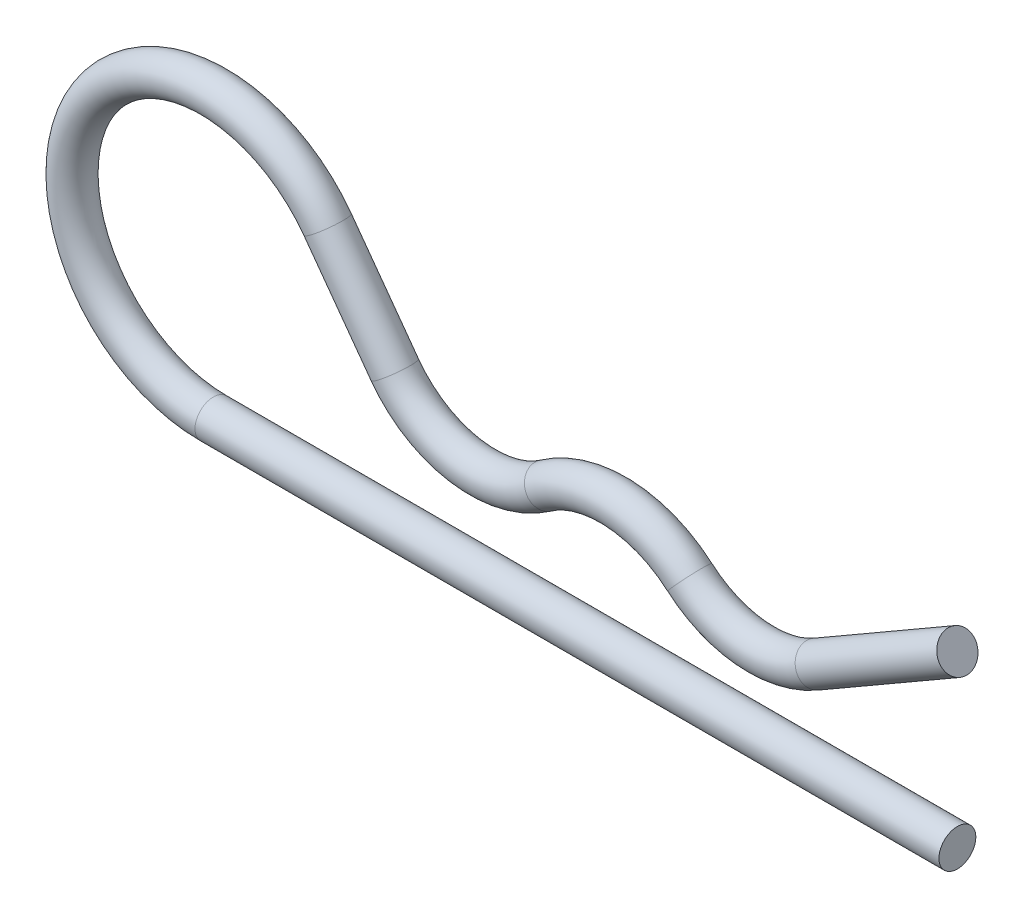
ISO-10303-21;
HEADER;
FILE_DESCRIPTION(('STEP AP214'),'2;1');
FILE_NAME('part.step','',(''),(''),'','','');
FILE_SCHEMA(('AUTOMOTIVE_DESIGN { 1 0 10303 214 1 1 1 1 }'));
ENDSEC;
DATA;
#1=APPLICATION_CONTEXT('core data for automotive mechanical design processes');
#2=APPLICATION_PROTOCOL_DEFINITION('international standard','automotive_design',2000,#1);
#3=PRODUCT_CONTEXT('',#1,'mechanical');
#4=PRODUCT('Part','Part','',(#3));
#5=PRODUCT_RELATED_PRODUCT_CATEGORY('part','',(#4));
#6=PRODUCT_DEFINITION_FORMATION('','',#4);
#7=PRODUCT_DEFINITION_CONTEXT('part definition',#1,'design');
#8=PRODUCT_DEFINITION('design','',#6,#7);
#9=PRODUCT_DEFINITION_SHAPE('','',#8);
#10=(LENGTH_UNIT() NAMED_UNIT(*) SI_UNIT(.MILLI.,.METRE.));
#11=(NAMED_UNIT(*) PLANE_ANGLE_UNIT() SI_UNIT($,.RADIAN.));
#12=(NAMED_UNIT(*) SI_UNIT($,.STERADIAN.) SOLID_ANGLE_UNIT());
#13=UNCERTAINTY_MEASURE_WITH_UNIT(LENGTH_MEASURE(1.E-05),#10,'distance_accuracy_value','');
#14=(GEOMETRIC_REPRESENTATION_CONTEXT(3) GLOBAL_UNCERTAINTY_ASSIGNED_CONTEXT((#13)) GLOBAL_UNIT_ASSIGNED_CONTEXT((#10,
#11,#12)) REPRESENTATION_CONTEXT('',''));
#15=CARTESIAN_POINT('',(0.,0.,0.));
#16=DIRECTION('',(0.,0.,1.));
#17=DIRECTION('',(1.,0.,0.));
#18=AXIS2_PLACEMENT_3D('',#15,#16,#17);
#19=CARTESIAN_POINT('',(60.5,2.31833780332165,0.));
#20=DIRECTION('',(-0.866025403784438,-0.500000000000002,0.));
#21=DIRECTION('',(0.,0.,-1.));
#22=AXIS2_PLACEMENT_3D('',#19,#20,#21);
#23=PLANE('',#22);
#24=CARTESIAN_POINT('',(60.5,2.31833780332165,0.));
#25=DIRECTION('',(-0.866025403784438,-0.500000000000002,0.));
#26=DIRECTION('',(0.,0.,-1.));
#27=AXIS2_PLACEMENT_3D('',#24,#25,#26);
#28=CIRCLE('',#27,1.5);
#29=CARTESIAN_POINT('',(60.5,2.31833780332165,-1.5));
#30=VERTEX_POINT('',#29);
#31=EDGE_CURVE('E63',#30,#30,#28,.T.);
#32=ORIENTED_EDGE('',*,*,#31,.F.);
#33=EDGE_LOOP('',(#32));
#34=FACE_BOUND('',#33,.T.);
#35=ADVANCED_FACE('F35',(#34),#23,.F.);
#36=CARTESIAN_POINT('',(60.5,-11.5,0.));
#37=DIRECTION('',(1.,0.,0.));
#38=DIRECTION('',(0.,0.,-1.));
#39=AXIS2_PLACEMENT_3D('',#36,#37,#38);
#40=PLANE('',#39);
#41=CARTESIAN_POINT('',(60.5,-11.5,0.));
#42=DIRECTION('',(1.,0.,0.));
#43=DIRECTION('',(0.,0.,-1.));
#44=AXIS2_PLACEMENT_3D('',#41,#42,#43);
#45=CIRCLE('',#44,1.5);
#46=CARTESIAN_POINT('',(60.5,-11.5,-1.5));
#47=VERTEX_POINT('',#46);
#48=EDGE_CURVE('E10',#47,#47,#45,.T.);
#49=ORIENTED_EDGE('',*,*,#48,.T.);
#50=EDGE_LOOP('',(#49));
#51=FACE_BOUND('',#50,.T.);
#52=ADVANCED_FACE('F70',(#51),#40,.T.);
#53=CARTESIAN_POINT('',(60.5,2.31833780332165,0.));
#54=DIRECTION('',(-0.866025403784438,-0.500000000000001,0.));
#55=DIRECTION('',(0.500000000000001,-0.866025403784438,0.));
#56=AXIS2_PLACEMENT_3D('',#53,#54,#55);
#57=CYLINDRICAL_SURFACE('',#56,1.5);
#58=CARTESIAN_POINT('',(48.9866630697245,-4.32889037264383,0.));
#59=DIRECTION('',(-0.866025403784438,-0.500000000000002,0.));
#60=DIRECTION('',(0.,0.,-1.));
#61=AXIS2_PLACEMENT_3D('',#58,#59,#60);
#62=CIRCLE('',#61,1.5);
#63=CARTESIAN_POINT('',(49.7366630697245,-5.62792847832049,0.));
#64=VERTEX_POINT('',#63);
#65=EDGE_CURVE('E60',#64,#64,#62,.T.);
#66=ORIENTED_EDGE('',*,*,#65,.F.);
#67=EDGE_LOOP('',(#66));
#68=FACE_BOUND('',#67,.T.);
#69=ORIENTED_EDGE('',*,*,#31,.T.);
#70=EDGE_LOOP('',(#69));
#71=FACE_BOUND('',#70,.T.);
#72=ADVANCED_FACE('F67',(#68,#71),#57,.T.);
#73=CARTESIAN_POINT('',(44.5580244186012,3.34173677946494,0.));
#74=DIRECTION('',(0.,0.,-1.));
#75=DIRECTION('',(-1.,0.,0.));
#76=AXIS2_PLACEMENT_3D('',#73,#74,#75);
#77=TOROIDAL_SURFACE('',#76,8.85727730224651,1.5);
#78=CARTESIAN_POINT('',(38.7400992309841,-3.33681903150067,0.));
#79=DIRECTION('',(-0.754019049315719,0.656852550629911,0.));
#80=DIRECTION('',(0.,0.,-1.));
#81=AXIS2_PLACEMENT_3D('',#78,#79,#80);
#82=CIRCLE('',#81,1.5);
#83=CARTESIAN_POINT('',(37.7548204050393,-4.46784760547424,0.));
#84=VERTEX_POINT('',#83);
#85=EDGE_CURVE('E57',#84,#84,#82,.T.);
#86=CARTESIAN_POINT('',(44.5580244186012,3.34173677946494,0.));
#87=DIRECTION('',(0.,0.,-1.));
#88=DIRECTION('',(-1.,0.,0.));
#89=AXIS2_PLACEMENT_3D('',#86,#87,#88);
#90=CIRCLE('',#89,10.3572773022465);
#91=EDGE_CURVE('',#64,#84,#90,.T.);
#92=ORIENTED_EDGE('',*,*,#65,.T.);
#93=ORIENTED_EDGE('',*,*,#85,.F.);
#94=ORIENTED_EDGE('',*,*,#91,.T.);
#95=ORIENTED_EDGE('',*,*,#91,.F.);
#96=EDGE_LOOP('',(#92,#94,#93,#95));
#97=FACE_BOUND('',#96,.T.);
#98=ADVANCED_FACE('F96',(#97),#77,.T.);
#99=CARTESIAN_POINT('',(32.5,-10.5,0.));
#100=DIRECTION('',(0.,0.,1.));
#101=DIRECTION('',(1.,0.,0.));
#102=AXIS2_PLACEMENT_3D('',#99,#100,#101);
#103=TOROIDAL_SURFACE('',#102,9.5,1.5);
#104=CARTESIAN_POINT('',(27.0208905677757,-2.73924231600347,0.));
#105=DIRECTION('',(-0.816921861473319,-0.576748361286764,0.));
#106=DIRECTION('',(0.,0.,-1.));
#107=AXIS2_PLACEMENT_3D('',#104,#105,#106);
#108=CIRCLE('',#107,1.5);
#109=CARTESIAN_POINT('',(27.8860131097059,-3.96462510821344,0.));
#110=VERTEX_POINT('',#109);
#111=EDGE_CURVE('E54',#110,#110,#108,.T.);
#112=ORIENTED_EDGE('',*,*,#111,.F.);
#113=EDGE_LOOP('',(#112));
#114=FACE_BOUND('',#113,.T.);
#115=ORIENTED_EDGE('',*,*,#85,.T.);
#116=EDGE_LOOP('',(#115));
#117=FACE_BOUND('',#116,.T.);
#118=ADVANCED_FACE('F92',(#114,#117),#103,.T.);
#119=CARTESIAN_POINT('',(21.9124703982426,4.49646114533313,0.));
#120=DIRECTION('',(0.,0.,-1.));
#121=DIRECTION('',(-1.,0.,0.));
#122=AXIS2_PLACEMENT_3D('',#119,#120,#121);
#123=TOROIDAL_SURFACE('',#122,8.8572773022465,1.5);
#124=CARTESIAN_POINT('',(14.7542347737251,-0.71995754499251,0.));
#125=DIRECTION('',(-0.588941557582552,0.808175625561819,0.));
#126=DIRECTION('',(0.,0.,-1.));
#127=AXIS2_PLACEMENT_3D('',#124,#125,#126);
#128=CIRCLE('',#127,1.5);
#129=CARTESIAN_POINT('',(13.5419713353823,-1.60336988136634,0.));
#130=VERTEX_POINT('',#129);
#131=EDGE_CURVE('E49',#130,#130,#128,.T.);
#132=CARTESIAN_POINT('',(21.9124703982426,4.49646114533313,0.));
#133=DIRECTION('',(0.,0.,-1.));
#134=DIRECTION('',(-1.,0.,0.));
#135=AXIS2_PLACEMENT_3D('',#132,#133,#134);
#136=CIRCLE('',#135,10.3572773022465);
#137=EDGE_CURVE('',#110,#130,#136,.T.);
#138=ORIENTED_EDGE('',*,*,#111,.T.);
#139=ORIENTED_EDGE('',*,*,#131,.F.);
#140=ORIENTED_EDGE('',*,*,#137,.T.);
#141=ORIENTED_EDGE('',*,*,#137,.F.);
#142=EDGE_LOOP('',(#138,#140,#139,#141));
#143=FACE_BOUND('',#142,.T.);
#144=ADVANCED_FACE('F88',(#143),#123,.T.);
#145=CARTESIAN_POINT('',(14.7542347737251,-0.71995754499251,0.));
#146=DIRECTION('',(-0.588941557582552,0.808175625561819,0.));
#147=DIRECTION('',(-0.808175625561819,-0.588941557582552,0.));
#148=AXIS2_PLACEMENT_3D('',#145,#146,#147);
#149=CYLINDRICAL_SURFACE('',#148,1.5);
#150=CARTESIAN_POINT('',(9.29401969396092,6.77282791219934,0.));
#151=DIRECTION('',(-0.588941557582552,0.808175625561819,0.));
#152=DIRECTION('',(0.,0.,-1.));
#153=AXIS2_PLACEMENT_3D('',#150,#151,#152);
#154=CIRCLE('',#153,1.5);
#155=CARTESIAN_POINT('',(10.5062831323037,7.65624024857317,0.));
#156=VERTEX_POINT('',#155);
#157=EDGE_CURVE('E45',#156,#156,#154,.T.);
#158=ORIENTED_EDGE('',*,*,#157,.F.);
#159=EDGE_LOOP('',(#158));
#160=FACE_BOUND('',#159,.T.);
#161=ORIENTED_EDGE('',*,*,#131,.T.);
#162=EDGE_LOOP('',(#161));
#163=FACE_BOUND('',#162,.T.);
#164=ADVANCED_FACE('F82',(#160,#163),#149,.T.);
#165=CARTESIAN_POINT('',(0.,0.,0.));
#166=DIRECTION('',(0.,0.,1.));
#167=DIRECTION('',(1.,0.,0.));
#168=AXIS2_PLACEMENT_3D('',#165,#166,#167);
#169=TOROIDAL_SURFACE('',#168,11.5,1.5);
#170=CARTESIAN_POINT('',(0.,-11.5,0.));
#171=DIRECTION('',(1.,0.,0.));
#172=DIRECTION('',(0.,0.,-1.));
#173=AXIS2_PLACEMENT_3D('',#170,#171,#172);
#174=CIRCLE('',#173,1.5);
#175=CARTESIAN_POINT('',(0.,-13.,0.));
#176=VERTEX_POINT('',#175);
#177=EDGE_CURVE('E41',#176,#176,#174,.T.);
#178=CARTESIAN_POINT('',(0.,0.,0.));
#179=DIRECTION('',(0.,0.,1.));
#180=DIRECTION('',(1.,0.,0.));
#181=AXIS2_PLACEMENT_3D('',#178,#179,#180);
#182=CIRCLE('',#181,13.);
#183=EDGE_CURVE('',#156,#176,#182,.T.);
#184=ORIENTED_EDGE('',*,*,#157,.T.);
#185=ORIENTED_EDGE('',*,*,#177,.F.);
#186=ORIENTED_EDGE('',*,*,#183,.T.);
#187=ORIENTED_EDGE('',*,*,#183,.F.);
#188=EDGE_LOOP('',(#184,#186,#185,#187));
#189=FACE_BOUND('',#188,.T.);
#190=ADVANCED_FACE('F76',(#189),#169,.T.);
#191=CARTESIAN_POINT('',(0.,-11.5,0.));
#192=DIRECTION('',(1.,0.,0.));
#193=DIRECTION('',(0.,0.,-1.));
#194=AXIS2_PLACEMENT_3D('',#191,#192,#193);
#195=CYLINDRICAL_SURFACE('',#194,1.5);
#196=ORIENTED_EDGE('',*,*,#48,.F.);
#197=EDGE_LOOP('',(#196));
#198=FACE_BOUND('',#197,.T.);
#199=ORIENTED_EDGE('',*,*,#177,.T.);
#200=EDGE_LOOP('',(#199));
#201=FACE_BOUND('',#200,.T.);
#202=ADVANCED_FACE('F74',(#198,#201),#195,.T.);
#203=CLOSED_SHELL('',(#35,#52,#72,#98,#118,#144,#164,#190,#202));
#204=MANIFOLD_SOLID_BREP('B2',#203);
#205=ADVANCED_BREP_SHAPE_REPRESENTATION('',(#18,#204),#14);
#206=SHAPE_DEFINITION_REPRESENTATION(#9,#205);
ENDSEC;
END-ISO-10303-21;
